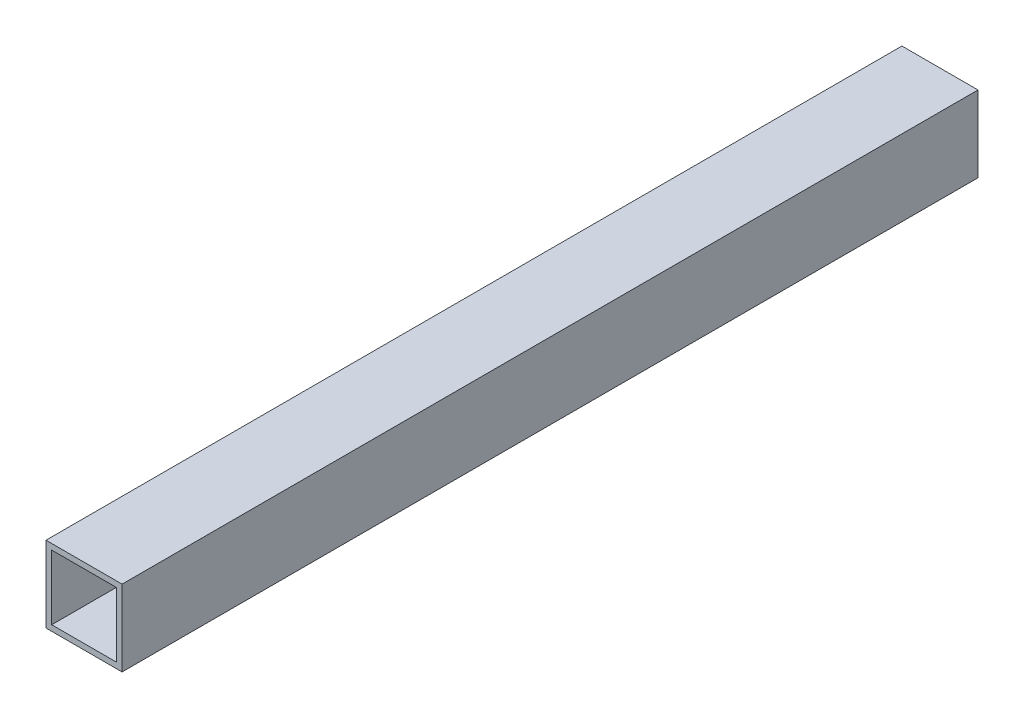
ISO-10303-21;
HEADER;
FILE_DESCRIPTION(('STEP AP214'),'2;1');
FILE_NAME('part.step','',(''),(''),'','','');
FILE_SCHEMA(('AUTOMOTIVE_DESIGN { 1 0 10303 214 1 1 1 1 }'));
ENDSEC;
DATA;
#1=APPLICATION_CONTEXT('core data for automotive mechanical design processes');
#2=APPLICATION_PROTOCOL_DEFINITION('international standard','automotive_design',2000,#1);
#3=PRODUCT_CONTEXT('',#1,'mechanical');
#4=PRODUCT('Part','Part','',(#3));
#5=PRODUCT_RELATED_PRODUCT_CATEGORY('part','',(#4));
#6=PRODUCT_DEFINITION_FORMATION('','',#4);
#7=PRODUCT_DEFINITION_CONTEXT('part definition',#1,'design');
#8=PRODUCT_DEFINITION('design','',#6,#7);
#9=PRODUCT_DEFINITION_SHAPE('','',#8);
#10=(LENGTH_UNIT() NAMED_UNIT(*) SI_UNIT(.MILLI.,.METRE.));
#11=(NAMED_UNIT(*) PLANE_ANGLE_UNIT() SI_UNIT($,.RADIAN.));
#12=(NAMED_UNIT(*) SI_UNIT($,.STERADIAN.) SOLID_ANGLE_UNIT());
#13=UNCERTAINTY_MEASURE_WITH_UNIT(LENGTH_MEASURE(1.E-05),#10,'distance_accuracy_value','');
#14=(GEOMETRIC_REPRESENTATION_CONTEXT(3) GLOBAL_UNCERTAINTY_ASSIGNED_CONTEXT((#13)) GLOBAL_UNIT_ASSIGNED_CONTEXT((#10,
#11,#12)) REPRESENTATION_CONTEXT('',''));
#15=CARTESIAN_POINT('',(0.,0.,0.));
#16=DIRECTION('',(0.,0.,1.));
#17=DIRECTION('',(1.,0.,0.));
#18=AXIS2_PLACEMENT_3D('',#15,#16,#17);
#19=CARTESIAN_POINT('',(0.,0.,450.));
#20=DIRECTION('',(0.,0.,1.));
#21=DIRECTION('',(1.,0.,0.));
#22=AXIS2_PLACEMENT_3D('',#19,#20,#21);
#23=PLANE('',#22);
#24=DIRECTION('',(0.,-1.,0.));
#25=VECTOR('',#24,1.);
#26=CARTESIAN_POINT('',(-20.,-20.,450.));
#27=LINE('',#26,#25);
#28=CARTESIAN_POINT('',(-20.,20.,450.));
#29=VERTEX_POINT('',#28);
#30=CARTESIAN_POINT('',(-20.,-20.,450.));
#31=VERTEX_POINT('',#30);
#32=EDGE_CURVE('E134',#29,#31,#27,.T.);
#33=ORIENTED_EDGE('',*,*,#32,.T.);
#34=DIRECTION('',(1.,0.,0.));
#35=VECTOR('',#34,1.);
#36=CARTESIAN_POINT('',(20.,-20.,450.));
#37=LINE('',#36,#35);
#38=CARTESIAN_POINT('',(20.,-20.,450.));
#39=VERTEX_POINT('',#38);
#40=EDGE_CURVE('E137',#31,#39,#37,.T.);
#41=ORIENTED_EDGE('',*,*,#40,.T.);
#42=DIRECTION('',(0.,1.,0.));
#43=VECTOR('',#42,1.);
#44=CARTESIAN_POINT('',(20.,-20.,450.));
#45=LINE('',#44,#43);
#46=CARTESIAN_POINT('',(20.,20.,450.));
#47=VERTEX_POINT('',#46);
#48=EDGE_CURVE('E140',#39,#47,#45,.T.);
#49=ORIENTED_EDGE('',*,*,#48,.T.);
#50=DIRECTION('',(-1.,0.,0.));
#51=VECTOR('',#50,1.);
#52=CARTESIAN_POINT('',(20.,20.,450.));
#53=LINE('',#52,#51);
#54=EDGE_CURVE('E142',#47,#29,#53,.T.);
#55=ORIENTED_EDGE('',*,*,#54,.T.);
#56=EDGE_LOOP('',(#33,#41,#49,#55));
#57=FACE_BOUND('',#56,.T.);
#58=DIRECTION('',(-1.,0.,0.));
#59=VECTOR('',#58,1.);
#60=CARTESIAN_POINT('',(17.,17.,450.));
#61=LINE('',#60,#59);
#62=CARTESIAN_POINT('',(17.,17.,450.));
#63=VERTEX_POINT('',#62);
#64=CARTESIAN_POINT('',(-17.,17.,450.));
#65=VERTEX_POINT('',#64);
#66=EDGE_CURVE('E106',#63,#65,#61,.T.);
#67=ORIENTED_EDGE('',*,*,#66,.F.);
#68=DIRECTION('',(0.,1.,0.));
#69=VECTOR('',#68,1.);
#70=CARTESIAN_POINT('',(17.,-17.,450.));
#71=LINE('',#70,#69);
#72=CARTESIAN_POINT('',(17.,-17.,450.));
#73=VERTEX_POINT('',#72);
#74=EDGE_CURVE('E98',#73,#63,#71,.T.);
#75=ORIENTED_EDGE('',*,*,#74,.F.);
#76=DIRECTION('',(1.,0.,0.));
#77=VECTOR('',#76,1.);
#78=CARTESIAN_POINT('',(17.,-17.,450.));
#79=LINE('',#78,#77);
#80=CARTESIAN_POINT('',(-17.,-17.,450.));
#81=VERTEX_POINT('',#80);
#82=EDGE_CURVE('E120',#81,#73,#79,.T.);
#83=ORIENTED_EDGE('',*,*,#82,.F.);
#84=DIRECTION('',(0.,-1.,0.));
#85=VECTOR('',#84,1.);
#86=CARTESIAN_POINT('',(-17.,-17.,450.));
#87=LINE('',#86,#85);
#88=EDGE_CURVE('E118',#65,#81,#87,.T.);
#89=ORIENTED_EDGE('',*,*,#88,.F.);
#90=EDGE_LOOP('',(#67,#75,#83,#89));
#91=FACE_BOUND('',#90,.T.);
#92=ADVANCED_FACE('F33',(#57,#91),#23,.T.);
#93=CARTESIAN_POINT('',(0.,0.,0.));
#94=DIRECTION('',(0.,0.,1.));
#95=DIRECTION('',(1.,0.,0.));
#96=AXIS2_PLACEMENT_3D('',#93,#94,#95);
#97=PLANE('',#96);
#98=DIRECTION('',(0.,-1.,0.));
#99=VECTOR('',#98,1.);
#100=CARTESIAN_POINT('',(-20.,-20.,0.));
#101=LINE('',#100,#99);
#102=CARTESIAN_POINT('',(-20.,20.,0.));
#103=VERTEX_POINT('',#102);
#104=CARTESIAN_POINT('',(-20.,-20.,0.));
#105=VERTEX_POINT('',#104);
#106=EDGE_CURVE('E114',#103,#105,#101,.T.);
#107=ORIENTED_EDGE('',*,*,#106,.F.);
#108=DIRECTION('',(-1.,0.,0.));
#109=VECTOR('',#108,1.);
#110=CARTESIAN_POINT('',(20.,20.,0.));
#111=LINE('',#110,#109);
#112=CARTESIAN_POINT('',(20.,20.,0.));
#113=VERTEX_POINT('',#112);
#114=EDGE_CURVE('E138',#113,#103,#111,.T.);
#115=ORIENTED_EDGE('',*,*,#114,.F.);
#116=DIRECTION('',(0.,1.,0.));
#117=VECTOR('',#116,1.);
#118=CARTESIAN_POINT('',(20.,-20.,0.));
#119=LINE('',#118,#117);
#120=CARTESIAN_POINT('',(20.,-20.,0.));
#121=VERTEX_POINT('',#120);
#122=EDGE_CURVE('E149',#121,#113,#119,.T.);
#123=ORIENTED_EDGE('',*,*,#122,.F.);
#124=DIRECTION('',(1.,0.,0.));
#125=VECTOR('',#124,1.);
#126=CARTESIAN_POINT('',(20.,-20.,0.));
#127=LINE('',#126,#125);
#128=EDGE_CURVE('E147',#105,#121,#127,.T.);
#129=ORIENTED_EDGE('',*,*,#128,.F.);
#130=EDGE_LOOP('',(#107,#115,#123,#129));
#131=FACE_BOUND('',#130,.T.);
#132=DIRECTION('',(0.,1.,0.));
#133=VECTOR('',#132,1.);
#134=CARTESIAN_POINT('',(17.,-17.,0.));
#135=LINE('',#134,#133);
#136=CARTESIAN_POINT('',(17.,-17.,0.));
#137=VERTEX_POINT('',#136);
#138=CARTESIAN_POINT('',(17.,17.,0.));
#139=VERTEX_POINT('',#138);
#140=EDGE_CURVE('E56',#137,#139,#135,.T.);
#141=ORIENTED_EDGE('',*,*,#140,.T.);
#142=DIRECTION('',(-1.,0.,0.));
#143=VECTOR('',#142,1.);
#144=CARTESIAN_POINT('',(17.,17.,0.));
#145=LINE('',#144,#143);
#146=CARTESIAN_POINT('',(-17.,17.,0.));
#147=VERTEX_POINT('',#146);
#148=EDGE_CURVE('E113',#139,#147,#145,.T.);
#149=ORIENTED_EDGE('',*,*,#148,.T.);
#150=DIRECTION('',(0.,-1.,0.));
#151=VECTOR('',#150,1.);
#152=CARTESIAN_POINT('',(-17.,-17.,0.));
#153=LINE('',#152,#151);
#154=CARTESIAN_POINT('',(-17.,-17.,0.));
#155=VERTEX_POINT('',#154);
#156=EDGE_CURVE('E126',#147,#155,#153,.T.);
#157=ORIENTED_EDGE('',*,*,#156,.T.);
#158=DIRECTION('',(1.,0.,0.));
#159=VECTOR('',#158,1.);
#160=CARTESIAN_POINT('',(17.,-17.,0.));
#161=LINE('',#160,#159);
#162=EDGE_CURVE('E107',#155,#137,#161,.T.);
#163=ORIENTED_EDGE('',*,*,#162,.T.);
#164=EDGE_LOOP('',(#141,#149,#157,#163));
#165=FACE_BOUND('',#164,.T.);
#166=ADVANCED_FACE('F167',(#131,#165),#97,.F.);
#167=CARTESIAN_POINT('',(-20.,-20.,450.));
#168=DIRECTION('',(1.,0.,0.));
#169=DIRECTION('',(0.,0.,-1.));
#170=AXIS2_PLACEMENT_3D('',#167,#168,#169);
#171=PLANE('',#170);
#172=ORIENTED_EDGE('',*,*,#106,.T.);
#173=DIRECTION('',(0.,0.,-1.));
#174=VECTOR('',#173,1.);
#175=CARTESIAN_POINT('',(-20.,-20.,450.));
#176=LINE('',#175,#174);
#177=EDGE_CURVE('E11',#31,#105,#176,.T.);
#178=ORIENTED_EDGE('',*,*,#177,.F.);
#179=ORIENTED_EDGE('',*,*,#32,.F.);
#180=DIRECTION('',(0.,0.,-1.));
#181=VECTOR('',#180,1.);
#182=CARTESIAN_POINT('',(-20.,20.,450.));
#183=LINE('',#182,#181);
#184=EDGE_CURVE('E144',#29,#103,#183,.T.);
#185=ORIENTED_EDGE('',*,*,#184,.T.);
#186=EDGE_LOOP('',(#172,#178,#179,#185));
#187=FACE_BOUND('',#186,.T.);
#188=ADVANCED_FACE('F35',(#187),#171,.F.);
#189=CARTESIAN_POINT('',(20.,-20.,450.));
#190=DIRECTION('',(0.,1.,0.));
#191=DIRECTION('',(0.,0.,1.));
#192=AXIS2_PLACEMENT_3D('',#189,#190,#191);
#193=PLANE('',#192);
#194=ORIENTED_EDGE('',*,*,#128,.T.);
#195=DIRECTION('',(0.,0.,-1.));
#196=VECTOR('',#195,1.);
#197=CARTESIAN_POINT('',(20.,-20.,450.));
#198=LINE('',#197,#196);
#199=EDGE_CURVE('E41',#39,#121,#198,.T.);
#200=ORIENTED_EDGE('',*,*,#199,.F.);
#201=ORIENTED_EDGE('',*,*,#40,.F.);
#202=ORIENTED_EDGE('',*,*,#177,.T.);
#203=EDGE_LOOP('',(#194,#200,#201,#202));
#204=FACE_BOUND('',#203,.T.);
#205=ADVANCED_FACE('F177',(#204),#193,.F.);
#206=CARTESIAN_POINT('',(20.,-20.,450.));
#207=DIRECTION('',(-1.,0.,0.));
#208=DIRECTION('',(0.,0.,1.));
#209=AXIS2_PLACEMENT_3D('',#206,#207,#208);
#210=PLANE('',#209);
#211=ORIENTED_EDGE('',*,*,#122,.T.);
#212=DIRECTION('',(0.,0.,-1.));
#213=VECTOR('',#212,1.);
#214=CARTESIAN_POINT('',(20.,20.,450.));
#215=LINE('',#214,#213);
#216=EDGE_CURVE('E154',#47,#113,#215,.T.);
#217=ORIENTED_EDGE('',*,*,#216,.F.);
#218=ORIENTED_EDGE('',*,*,#48,.F.);
#219=ORIENTED_EDGE('',*,*,#199,.T.);
#220=EDGE_LOOP('',(#211,#217,#218,#219));
#221=FACE_BOUND('',#220,.T.);
#222=ADVANCED_FACE('F161',(#221),#210,.F.);
#223=CARTESIAN_POINT('',(20.,20.,450.));
#224=DIRECTION('',(0.,-1.,0.));
#225=DIRECTION('',(0.,0.,-1.));
#226=AXIS2_PLACEMENT_3D('',#223,#224,#225);
#227=PLANE('',#226);
#228=ORIENTED_EDGE('',*,*,#114,.T.);
#229=ORIENTED_EDGE('',*,*,#184,.F.);
#230=ORIENTED_EDGE('',*,*,#54,.F.);
#231=ORIENTED_EDGE('',*,*,#216,.T.);
#232=EDGE_LOOP('',(#228,#229,#230,#231));
#233=FACE_BOUND('',#232,.T.);
#234=ADVANCED_FACE('F171',(#233),#227,.F.);
#235=CARTESIAN_POINT('',(17.,-17.,450.));
#236=DIRECTION('',(-1.,0.,0.));
#237=DIRECTION('',(0.,0.,1.));
#238=AXIS2_PLACEMENT_3D('',#235,#236,#237);
#239=PLANE('',#238);
#240=ORIENTED_EDGE('',*,*,#140,.F.);
#241=DIRECTION('',(0.,0.,-1.));
#242=VECTOR('',#241,1.);
#243=CARTESIAN_POINT('',(17.,-17.,450.));
#244=LINE('',#243,#242);
#245=EDGE_CURVE('E102',#73,#137,#244,.T.);
#246=ORIENTED_EDGE('',*,*,#245,.F.);
#247=ORIENTED_EDGE('',*,*,#74,.T.);
#248=DIRECTION('',(0.,0.,-1.));
#249=VECTOR('',#248,1.);
#250=CARTESIAN_POINT('',(17.,17.,450.));
#251=LINE('',#250,#249);
#252=EDGE_CURVE('E101',#63,#139,#251,.T.);
#253=ORIENTED_EDGE('',*,*,#252,.T.);
#254=EDGE_LOOP('',(#240,#246,#247,#253));
#255=FACE_BOUND('',#254,.T.);
#256=ADVANCED_FACE('F100',(#255),#239,.T.);
#257=CARTESIAN_POINT('',(17.,17.,450.));
#258=DIRECTION('',(0.,-1.,0.));
#259=DIRECTION('',(1.,0.,0.));
#260=AXIS2_PLACEMENT_3D('',#257,#258,#259);
#261=PLANE('',#260);
#262=ORIENTED_EDGE('',*,*,#148,.F.);
#263=ORIENTED_EDGE('',*,*,#252,.F.);
#264=ORIENTED_EDGE('',*,*,#66,.T.);
#265=DIRECTION('',(0.,0.,-1.));
#266=VECTOR('',#265,1.);
#267=CARTESIAN_POINT('',(-17.,17.,450.));
#268=LINE('',#267,#266);
#269=EDGE_CURVE('E115',#65,#147,#268,.T.);
#270=ORIENTED_EDGE('',*,*,#269,.T.);
#271=EDGE_LOOP('',(#262,#263,#264,#270));
#272=FACE_BOUND('',#271,.T.);
#273=ADVANCED_FACE('F110',(#272),#261,.T.);
#274=CARTESIAN_POINT('',(-17.,-17.,450.));
#275=DIRECTION('',(1.,0.,0.));
#276=DIRECTION('',(0.,0.,-1.));
#277=AXIS2_PLACEMENT_3D('',#274,#275,#276);
#278=PLANE('',#277);
#279=ORIENTED_EDGE('',*,*,#156,.F.);
#280=ORIENTED_EDGE('',*,*,#269,.F.);
#281=ORIENTED_EDGE('',*,*,#88,.T.);
#282=DIRECTION('',(0.,0.,-1.));
#283=VECTOR('',#282,1.);
#284=CARTESIAN_POINT('',(-17.,-17.,450.));
#285=LINE('',#284,#283);
#286=EDGE_CURVE('E48',#81,#155,#285,.T.);
#287=ORIENTED_EDGE('',*,*,#286,.T.);
#288=EDGE_LOOP('',(#279,#280,#281,#287));
#289=FACE_BOUND('',#288,.T.);
#290=ADVANCED_FACE('F200',(#289),#278,.T.);
#291=CARTESIAN_POINT('',(17.,-17.,450.));
#292=DIRECTION('',(0.,1.,0.));
#293=DIRECTION('',(-1.,0.,0.));
#294=AXIS2_PLACEMENT_3D('',#291,#292,#293);
#295=PLANE('',#294);
#296=ORIENTED_EDGE('',*,*,#162,.F.);
#297=ORIENTED_EDGE('',*,*,#286,.F.);
#298=ORIENTED_EDGE('',*,*,#82,.T.);
#299=ORIENTED_EDGE('',*,*,#245,.T.);
#300=EDGE_LOOP('',(#296,#297,#298,#299));
#301=FACE_BOUND('',#300,.T.);
#302=ADVANCED_FACE('F204',(#301),#295,.T.);
#303=CLOSED_SHELL('',(#92,#166,#188,#205,#222,#234,#256,#273,#290,#302));
#304=MANIFOLD_SOLID_BREP('B2',#303);
#305=ADVANCED_BREP_SHAPE_REPRESENTATION('',(#18,#304),#14);
#306=SHAPE_DEFINITION_REPRESENTATION(#9,#305);
ENDSEC;
END-ISO-10303-21;
